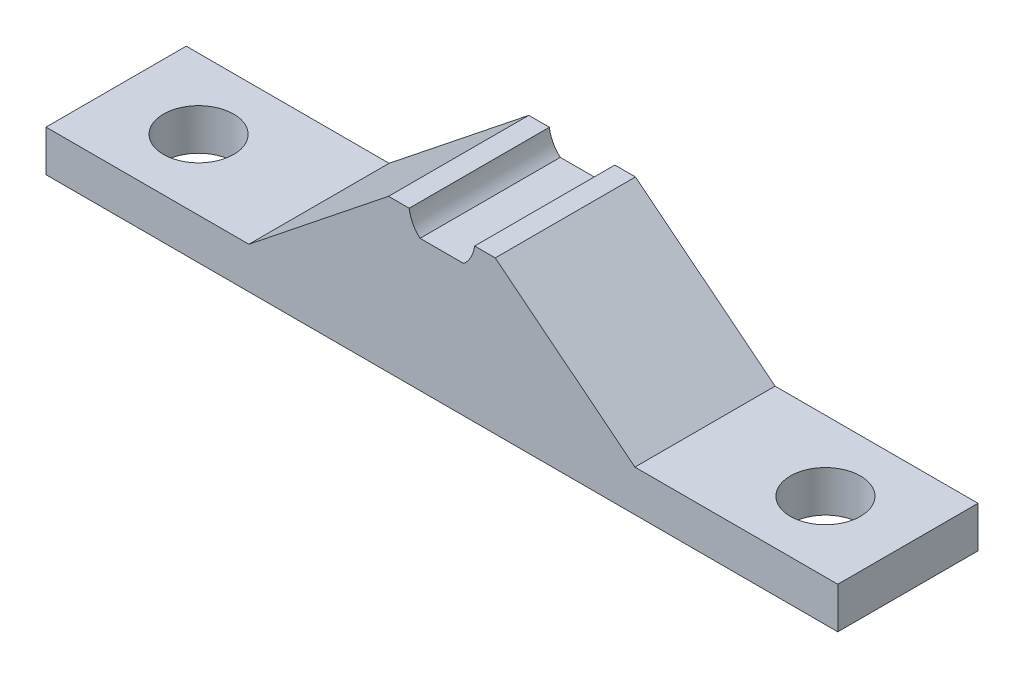
ISO-10303-21;
HEADER;
FILE_DESCRIPTION(('STEP AP214'),'2;1');
FILE_NAME('part.step','',(''),(''),'','','');
FILE_SCHEMA(('AUTOMOTIVE_DESIGN { 1 0 10303 214 1 1 1 1 }'));
ENDSEC;
DATA;
#1=APPLICATION_CONTEXT('core data for automotive mechanical design processes');
#2=APPLICATION_PROTOCOL_DEFINITION('international standard','automotive_design',2000,#1);
#3=PRODUCT_CONTEXT('',#1,'mechanical');
#4=PRODUCT('Part','Part','',(#3));
#5=PRODUCT_RELATED_PRODUCT_CATEGORY('part','',(#4));
#6=PRODUCT_DEFINITION_FORMATION('','',#4);
#7=PRODUCT_DEFINITION_CONTEXT('part definition',#1,'design');
#8=PRODUCT_DEFINITION('design','',#6,#7);
#9=PRODUCT_DEFINITION_SHAPE('','',#8);
#10=(LENGTH_UNIT() NAMED_UNIT(*) SI_UNIT(.MILLI.,.METRE.));
#11=(NAMED_UNIT(*) PLANE_ANGLE_UNIT() SI_UNIT($,.RADIAN.));
#12=(NAMED_UNIT(*) SI_UNIT($,.STERADIAN.) SOLID_ANGLE_UNIT());
#13=UNCERTAINTY_MEASURE_WITH_UNIT(LENGTH_MEASURE(1.E-05),#10,'distance_accuracy_value','');
#14=(GEOMETRIC_REPRESENTATION_CONTEXT(3) GLOBAL_UNCERTAINTY_ASSIGNED_CONTEXT((#13)) GLOBAL_UNIT_ASSIGNED_CONTEXT((#10,
#11,#12)) REPRESENTATION_CONTEXT('',''));
#15=CARTESIAN_POINT('',(0.,0.,0.));
#16=DIRECTION('',(0.,0.,1.));
#17=DIRECTION('',(1.,0.,0.));
#18=AXIS2_PLACEMENT_3D('',#15,#16,#17);
#19=CARTESIAN_POINT('',(0.,-37.9999999999996,-138.785495179433));
#20=DIRECTION('',(0.,-1.,0.));
#21=DIRECTION('',(1.,0.,0.));
#22=AXIS2_PLACEMENT_3D('',#19,#20,#21);
#23=PLANE('',#22);
#24=CARTESIAN_POINT('',(-75.9999999999999,-37.9999999999996,-16.9999999999999));
#25=DIRECTION('',(0.,-1.,0.));
#26=DIRECTION('',(1.,0.,0.));
#27=AXIS2_PLACEMENT_3D('',#24,#25,#26);
#28=CIRCLE('',#27,8.50000000000001);
#29=CARTESIAN_POINT('',(-67.4999999999999,-37.9999999999996,-16.9999999999999));
#30=VERTEX_POINT('',#29);
#31=EDGE_CURVE('E170',#30,#30,#28,.T.);
#32=ORIENTED_EDGE('',*,*,#31,.F.);
#33=EDGE_LOOP('',(#32));
#34=FACE_BOUND('',#33,.T.);
#35=DIRECTION('',(-1.,0.,0.));
#36=VECTOR('',#35,1.);
#37=CARTESIAN_POINT('',(0.,-37.9999999999996,-33.9999999999999));
#38=LINE('',#37,#36);
#39=CARTESIAN_POINT('',(95.9999999999999,-37.9999999999996,-33.9999999999999));
#40=VERTEX_POINT('',#39);
#41=CARTESIAN_POINT('',(-95.9999999999999,-37.9999999999996,-33.9999999999999));
#42=VERTEX_POINT('',#41);
#43=EDGE_CURVE('E56',#40,#42,#38,.T.);
#44=ORIENTED_EDGE('',*,*,#43,.F.);
#45=DIRECTION('',(0.,0.,1.));
#46=VECTOR('',#45,1.);
#47=CARTESIAN_POINT('',(95.9999999999999,-37.9999999999996,-138.785495179433));
#48=LINE('',#47,#46);
#49=CARTESIAN_POINT('',(95.9999999999999,-37.9999999999996,0.));
#50=VERTEX_POINT('',#49);
#51=EDGE_CURVE('E236',#40,#50,#48,.T.);
#52=ORIENTED_EDGE('',*,*,#51,.T.);
#53=DIRECTION('',(1.,0.,0.));
#54=VECTOR('',#53,1.);
#55=CARTESIAN_POINT('',(0.,-37.9999999999996,0.));
#56=LINE('',#55,#54);
#57=CARTESIAN_POINT('',(-95.9999999999999,-37.9999999999996,0.));
#58=VERTEX_POINT('',#57);
#59=EDGE_CURVE('E199',#58,#50,#56,.T.);
#60=ORIENTED_EDGE('',*,*,#59,.F.);
#61=DIRECTION('',(0.,0.,1.));
#62=VECTOR('',#61,1.);
#63=CARTESIAN_POINT('',(-95.9999999999999,-37.9999999999996,-138.785495179433));
#64=LINE('',#63,#62);
#65=EDGE_CURVE('E178',#42,#58,#64,.T.);
#66=ORIENTED_EDGE('',*,*,#65,.F.);
#67=EDGE_LOOP('',(#44,#52,#60,#66));
#68=FACE_BOUND('',#67,.T.);
#69=CARTESIAN_POINT('',(75.9999999999999,-37.9999999999996,-16.9999999999999));
#70=DIRECTION('',(0.,1.,0.));
#71=DIRECTION('',(-1.,0.,0.));
#72=AXIS2_PLACEMENT_3D('',#69,#70,#71);
#73=CIRCLE('',#72,8.50000000000001);
#74=CARTESIAN_POINT('',(67.4999999999999,-37.9999999999996,-16.9999999999999));
#75=VERTEX_POINT('',#74);
#76=EDGE_CURVE('E273',#75,#75,#73,.T.);
#77=ORIENTED_EDGE('',*,*,#76,.T.);
#78=EDGE_LOOP('',(#77));
#79=FACE_BOUND('',#78,.T.);
#80=ADVANCED_FACE('F48',(#34,#68,#79),#23,.T.);
#81=CARTESIAN_POINT('',(-95.9999999999999,-37.9999999999996,-138.785495179433));
#82=DIRECTION('',(-1.,0.,0.));
#83=DIRECTION('',(0.,0.,1.));
#84=AXIS2_PLACEMENT_3D('',#81,#82,#83);
#85=PLANE('',#84);
#86=DIRECTION('',(0.,1.,0.));
#87=VECTOR('',#86,1.);
#88=CARTESIAN_POINT('',(-95.9999999999999,-37.9999999999996,-33.9999999999999));
#89=LINE('',#88,#87);
#90=CARTESIAN_POINT('',(-95.9999999999999,-27.9999999999996,-33.9999999999999));
#91=VERTEX_POINT('',#90);
#92=EDGE_CURVE('E183',#42,#91,#89,.T.);
#93=ORIENTED_EDGE('',*,*,#92,.F.);
#94=ORIENTED_EDGE('',*,*,#65,.T.);
#95=DIRECTION('',(0.,-1.,0.));
#96=VECTOR('',#95,1.);
#97=CARTESIAN_POINT('',(-95.9999999999999,-37.9999999999996,0.));
#98=LINE('',#97,#96);
#99=CARTESIAN_POINT('',(-95.9999999999999,-27.9999999999996,0.));
#100=VERTEX_POINT('',#99);
#101=EDGE_CURVE('E196',#100,#58,#98,.T.);
#102=ORIENTED_EDGE('',*,*,#101,.F.);
#103=DIRECTION('',(0.,0.,1.));
#104=VECTOR('',#103,1.);
#105=CARTESIAN_POINT('',(-95.9999999999999,-27.9999999999996,-138.785495179433));
#106=LINE('',#105,#104);
#107=EDGE_CURVE('E202',#91,#100,#106,.T.);
#108=ORIENTED_EDGE('',*,*,#107,.F.);
#109=EDGE_LOOP('',(#93,#94,#102,#108));
#110=FACE_BOUND('',#109,.T.);
#111=ADVANCED_FACE('F228',(#110),#85,.T.);
#112=CARTESIAN_POINT('',(-95.9999999999999,-27.9999999999996,-138.785495179433));
#113=DIRECTION('',(0.,1.,0.));
#114=DIRECTION('',(-1.,0.,0.));
#115=AXIS2_PLACEMENT_3D('',#112,#113,#114);
#116=PLANE('',#115);
#117=CARTESIAN_POINT('',(-75.9999999999999,-27.9999999999996,-16.9999999999999));
#118=DIRECTION('',(0.,1.,0.));
#119=DIRECTION('',(-1.,0.,0.));
#120=AXIS2_PLACEMENT_3D('',#117,#118,#119);
#121=CIRCLE('',#120,8.50000000000001);
#122=CARTESIAN_POINT('',(-84.4999999999999,-27.9999999999996,-16.9999999999999));
#123=VERTEX_POINT('',#122);
#124=EDGE_CURVE('E146',#123,#123,#121,.F.);
#125=ORIENTED_EDGE('',*,*,#124,.T.);
#126=EDGE_LOOP('',(#125));
#127=FACE_BOUND('',#126,.T.);
#128=DIRECTION('',(1.,0.,0.));
#129=VECTOR('',#128,1.);
#130=CARTESIAN_POINT('',(-95.9999999999999,-27.9999999999996,-33.9999999999999));
#131=LINE('',#130,#129);
#132=CARTESIAN_POINT('',(-46.8017522130597,-27.9999999999996,-33.9999999999999));
#133=VERTEX_POINT('',#132);
#134=EDGE_CURVE('E181',#91,#133,#131,.T.);
#135=ORIENTED_EDGE('',*,*,#134,.F.);
#136=ORIENTED_EDGE('',*,*,#107,.T.);
#137=DIRECTION('',(-1.,0.,0.));
#138=VECTOR('',#137,1.);
#139=CARTESIAN_POINT('',(-95.9999999999999,-27.9999999999996,0.));
#140=LINE('',#139,#138);
#141=CARTESIAN_POINT('',(-46.8017522130597,-27.9999999999996,0.));
#142=VERTEX_POINT('',#141);
#143=EDGE_CURVE('E193',#142,#100,#140,.T.);
#144=ORIENTED_EDGE('',*,*,#143,.F.);
#145=DIRECTION('',(0.,0.,1.));
#146=VECTOR('',#145,1.);
#147=CARTESIAN_POINT('',(-46.8017522130597,-27.9999999999996,-138.785495179433));
#148=LINE('',#147,#146);
#149=EDGE_CURVE('E204',#133,#142,#148,.T.);
#150=ORIENTED_EDGE('',*,*,#149,.F.);
#151=EDGE_LOOP('',(#135,#136,#144,#150));
#152=FACE_BOUND('',#151,.T.);
#153=ADVANCED_FACE('F223',(#127,#152),#116,.T.);
#154=CARTESIAN_POINT('',(-46.8017522130597,-27.9999999999996,-138.785495179433));
#155=DIRECTION('',(-0.623404606589831,0.781899415834657,0.));
#156=DIRECTION('',(-0.781899415834657,-0.623404606589832,0.));
#157=AXIS2_PLACEMENT_3D('',#154,#155,#156);
#158=PLANE('',#157);
#159=DIRECTION('',(0.781899415834657,0.623404606589832,0.));
#160=VECTOR('',#159,1.);
#161=CARTESIAN_POINT('',(-46.8017522130597,-27.9999999999996,-33.9999999999999));
#162=LINE('',#161,#160);
#163=CARTESIAN_POINT('',(-12.937253933172,-1.,-33.9999999999999));
#164=VERTEX_POINT('',#163);
#165=EDGE_CURVE('E68',#133,#164,#162,.T.);
#166=ORIENTED_EDGE('',*,*,#165,.F.);
#167=ORIENTED_EDGE('',*,*,#149,.T.);
#168=DIRECTION('',(-0.781899415834657,-0.623404606589832,0.));
#169=VECTOR('',#168,1.);
#170=CARTESIAN_POINT('',(-46.8017522130597,-27.9999999999996,0.));
#171=LINE('',#170,#169);
#172=CARTESIAN_POINT('',(-12.937253933172,-1.,0.));
#173=VERTEX_POINT('',#172);
#174=EDGE_CURVE('E190',#173,#142,#171,.T.);
#175=ORIENTED_EDGE('',*,*,#174,.F.);
#176=DIRECTION('',(0.,0.,1.));
#177=VECTOR('',#176,1.);
#178=CARTESIAN_POINT('',(-12.937253933172,-1.,-138.785495179433));
#179=LINE('',#178,#177);
#180=EDGE_CURVE('E206',#164,#173,#179,.T.);
#181=ORIENTED_EDGE('',*,*,#180,.F.);
#182=EDGE_LOOP('',(#166,#167,#175,#181));
#183=FACE_BOUND('',#182,.T.);
#184=ADVANCED_FACE('F219',(#183),#158,.T.);
#185=CARTESIAN_POINT('',(-12.937253933172,-1.,-138.785495179433));
#186=DIRECTION('',(0.,1.,0.));
#187=DIRECTION('',(0.,0.,1.));
#188=AXIS2_PLACEMENT_3D('',#185,#186,#187);
#189=PLANE('',#188);
#190=DIRECTION('',(1.,0.,0.));
#191=VECTOR('',#190,1.);
#192=CARTESIAN_POINT('',(-12.937253933172,-1.,-33.9999999999999));
#193=LINE('',#192,#191);
#194=CARTESIAN_POINT('',(-7.93725393317202,-0.999999999999997,-33.9999999999999));
#195=VERTEX_POINT('',#194);
#196=EDGE_CURVE('E63',#164,#195,#193,.T.);
#197=ORIENTED_EDGE('',*,*,#196,.F.);
#198=ORIENTED_EDGE('',*,*,#180,.T.);
#199=DIRECTION('',(-1.,0.,0.));
#200=VECTOR('',#199,1.);
#201=CARTESIAN_POINT('',(-12.937253933172,-1.,0.));
#202=LINE('',#201,#200);
#203=CARTESIAN_POINT('',(-7.93725393317202,-0.999999999999997,0.));
#204=VERTEX_POINT('',#203);
#205=EDGE_CURVE('E187',#204,#173,#202,.T.);
#206=ORIENTED_EDGE('',*,*,#205,.F.);
#207=DIRECTION('',(0.,0.,1.));
#208=VECTOR('',#207,1.);
#209=CARTESIAN_POINT('',(-7.93725393317202,-0.999999999999997,-138.785495179433));
#210=LINE('',#209,#208);
#211=EDGE_CURVE('E208',#195,#204,#210,.T.);
#212=ORIENTED_EDGE('',*,*,#211,.F.);
#213=EDGE_LOOP('',(#197,#198,#206,#212));
#214=FACE_BOUND('',#213,.T.);
#215=ADVANCED_FACE('F214',(#214),#189,.T.);
#216=CARTESIAN_POINT('',(0.,0.,-138.785495179433));
#217=DIRECTION('',(0.,0.,1.));
#218=DIRECTION('',(1.,0.,0.));
#219=AXIS2_PLACEMENT_3D('',#216,#217,#218);
#220=CYLINDRICAL_SURFACE('',#219,7.99999999997842);
#221=CARTESIAN_POINT('',(0.,0.,-33.9999999999999));
#222=DIRECTION('',(0.,0.,1.));
#223=DIRECTION('',(1.,0.,0.));
#224=AXIS2_PLACEMENT_3D('',#221,#222,#223);
#225=CIRCLE('',#224,7.99999999997842);
#226=CARTESIAN_POINT('',(-5.29150262212852,-5.99999999997181,-33.9999999999999));
#227=VERTEX_POINT('',#226);
#228=EDGE_CURVE('E176',#195,#227,#225,.T.);
#229=ORIENTED_EDGE('',*,*,#228,.F.);
#230=ORIENTED_EDGE('',*,*,#211,.T.);
#231=CARTESIAN_POINT('',(0.,0.,0.));
#232=DIRECTION('',(0.,0.,-1.));
#233=DIRECTION('',(1.,0.,0.));
#234=AXIS2_PLACEMENT_3D('',#231,#232,#233);
#235=CIRCLE('',#234,7.99999999997842);
#236=CARTESIAN_POINT('',(-5.29150262212852,-5.99999999997181,0.));
#237=VERTEX_POINT('',#236);
#238=EDGE_CURVE('E145',#237,#204,#235,.T.);
#239=ORIENTED_EDGE('',*,*,#238,.F.);
#240=DIRECTION('',(0.,0.,1.));
#241=VECTOR('',#240,1.);
#242=CARTESIAN_POINT('',(-5.29150262212852,-5.99999999997181,-138.785495179433));
#243=LINE('',#242,#241);
#244=EDGE_CURVE('E141',#227,#237,#243,.T.);
#245=ORIENTED_EDGE('',*,*,#244,.F.);
#246=EDGE_LOOP('',(#229,#230,#239,#245));
#247=FACE_BOUND('',#246,.T.);
#248=ADVANCED_FACE('F212',(#247),#220,.F.);
#249=CARTESIAN_POINT('',(0.,-5.99999999997181,-138.785495179433));
#250=DIRECTION('',(0.,1.,0.));
#251=DIRECTION('',(-1.,0.,0.));
#252=AXIS2_PLACEMENT_3D('',#249,#250,#251);
#253=PLANE('',#252);
#254=DIRECTION('',(1.,0.,0.));
#255=VECTOR('',#254,1.);
#256=CARTESIAN_POINT('',(0.,-5.99999999997181,-33.9999999999999));
#257=LINE('',#256,#255);
#258=CARTESIAN_POINT('',(5.29150262212852,-5.99999999997181,-33.9999999999999));
#259=VERTEX_POINT('',#258);
#260=EDGE_CURVE('E14',#227,#259,#257,.T.);
#261=ORIENTED_EDGE('',*,*,#260,.F.);
#262=ORIENTED_EDGE('',*,*,#244,.T.);
#263=DIRECTION('',(-1.,0.,0.));
#264=VECTOR('',#263,1.);
#265=CARTESIAN_POINT('',(0.,-5.99999999997181,0.));
#266=LINE('',#265,#264);
#267=CARTESIAN_POINT('',(5.29150262212852,-5.99999999997181,0.));
#268=VERTEX_POINT('',#267);
#269=EDGE_CURVE('E134',#268,#237,#266,.T.);
#270=ORIENTED_EDGE('',*,*,#269,.F.);
#271=DIRECTION('',(0.,0.,1.));
#272=VECTOR('',#271,1.);
#273=CARTESIAN_POINT('',(5.29150262212852,-5.99999999997181,-138.785495179433));
#274=LINE('',#273,#272);
#275=EDGE_CURVE('E138',#259,#268,#274,.T.);
#276=ORIENTED_EDGE('',*,*,#275,.F.);
#277=EDGE_LOOP('',(#261,#262,#270,#276));
#278=FACE_BOUND('',#277,.T.);
#279=ADVANCED_FACE('F50',(#278),#253,.T.);
#280=CARTESIAN_POINT('',(0.,0.,0.));
#281=DIRECTION('',(0.,0.,1.));
#282=DIRECTION('',(1.,0.,0.));
#283=AXIS2_PLACEMENT_3D('',#280,#281,#282);
#284=PLANE('',#283);
#285=ORIENTED_EDGE('',*,*,#59,.T.);
#286=DIRECTION('',(0.,-1.,0.));
#287=VECTOR('',#286,1.);
#288=CARTESIAN_POINT('',(95.9999999999999,-37.9999999999996,0.));
#289=LINE('',#288,#287);
#290=CARTESIAN_POINT('',(95.9999999999999,-27.9999999999996,0.));
#291=VERTEX_POINT('',#290);
#292=EDGE_CURVE('E161',#291,#50,#289,.T.);
#293=ORIENTED_EDGE('',*,*,#292,.F.);
#294=DIRECTION('',(1.,0.,0.));
#295=VECTOR('',#294,1.);
#296=CARTESIAN_POINT('',(95.9999999999999,-27.9999999999996,0.));
#297=LINE('',#296,#295);
#298=CARTESIAN_POINT('',(46.8017522130597,-27.9999999999996,0.));
#299=VERTEX_POINT('',#298);
#300=EDGE_CURVE('E166',#299,#291,#297,.T.);
#301=ORIENTED_EDGE('',*,*,#300,.F.);
#302=DIRECTION('',(0.781899415834657,-0.623404606589831,0.));
#303=VECTOR('',#302,1.);
#304=CARTESIAN_POINT('',(46.8017522130597,-27.9999999999996,0.));
#305=LINE('',#304,#303);
#306=CARTESIAN_POINT('',(12.937253933172,-0.999999999999997,0.));
#307=VERTEX_POINT('',#306);
#308=EDGE_CURVE('E256',#307,#299,#305,.T.);
#309=ORIENTED_EDGE('',*,*,#308,.F.);
#310=DIRECTION('',(1.,0.,0.));
#311=VECTOR('',#310,1.);
#312=CARTESIAN_POINT('',(12.937253933172,-0.999999999999997,0.));
#313=LINE('',#312,#311);
#314=CARTESIAN_POINT('',(7.93725393317202,-0.999999999999997,0.));
#315=VERTEX_POINT('',#314);
#316=EDGE_CURVE('E152',#315,#307,#313,.T.);
#317=ORIENTED_EDGE('',*,*,#316,.F.);
#318=CARTESIAN_POINT('',(0.,0.,0.));
#319=DIRECTION('',(0.,0.,1.));
#320=DIRECTION('',(-1.,0.,0.));
#321=AXIS2_PLACEMENT_3D('',#318,#319,#320);
#322=CIRCLE('',#321,7.99999999997842);
#323=EDGE_CURVE('E149',#268,#315,#322,.T.);
#324=ORIENTED_EDGE('',*,*,#323,.F.);
#325=ORIENTED_EDGE('',*,*,#269,.T.);
#326=ORIENTED_EDGE('',*,*,#238,.T.);
#327=ORIENTED_EDGE('',*,*,#205,.T.);
#328=ORIENTED_EDGE('',*,*,#174,.T.);
#329=ORIENTED_EDGE('',*,*,#143,.T.);
#330=ORIENTED_EDGE('',*,*,#101,.T.);
#331=EDGE_LOOP('',(#285,#293,#301,#309,#317,#324,#325,#326,#327,#328,#329,#330));
#332=FACE_BOUND('',#331,.T.);
#333=ADVANCED_FACE('F150',(#332),#284,.T.);
#334=CARTESIAN_POINT('',(7.99999999999956,0.,-33.9999999999999));
#335=DIRECTION('',(0.,0.,1.));
#336=DIRECTION('',(0.,-1.,0.));
#337=AXIS2_PLACEMENT_3D('',#334,#335,#336);
#338=PLANE('',#337);
#339=ORIENTED_EDGE('',*,*,#260,.T.);
#340=CARTESIAN_POINT('',(0.,0.,-33.9999999999999));
#341=DIRECTION('',(0.,0.,-1.));
#342=DIRECTION('',(-1.,0.,0.));
#343=AXIS2_PLACEMENT_3D('',#340,#341,#342);
#344=CIRCLE('',#343,7.99999999997842);
#345=CARTESIAN_POINT('',(7.93725393317202,-0.999999999999997,-33.9999999999999));
#346=VERTEX_POINT('',#345);
#347=EDGE_CURVE('E159',#346,#259,#344,.T.);
#348=ORIENTED_EDGE('',*,*,#347,.F.);
#349=DIRECTION('',(-1.,0.,0.));
#350=VECTOR('',#349,1.);
#351=CARTESIAN_POINT('',(12.937253933172,-0.999999999999997,-33.9999999999999));
#352=LINE('',#351,#350);
#353=CARTESIAN_POINT('',(12.937253933172,-0.999999999999997,-33.9999999999999));
#354=VERTEX_POINT('',#353);
#355=EDGE_CURVE('E242',#354,#346,#352,.T.);
#356=ORIENTED_EDGE('',*,*,#355,.F.);
#357=DIRECTION('',(-0.781899415834657,0.623404606589831,0.));
#358=VECTOR('',#357,1.);
#359=CARTESIAN_POINT('',(46.8017522130597,-27.9999999999996,-33.9999999999999));
#360=LINE('',#359,#358);
#361=CARTESIAN_POINT('',(46.8017522130597,-27.9999999999996,-33.9999999999999));
#362=VERTEX_POINT('',#361);
#363=EDGE_CURVE('E258',#362,#354,#360,.T.);
#364=ORIENTED_EDGE('',*,*,#363,.F.);
#365=DIRECTION('',(-1.,0.,0.));
#366=VECTOR('',#365,1.);
#367=CARTESIAN_POINT('',(95.9999999999999,-27.9999999999996,-33.9999999999999));
#368=LINE('',#367,#366);
#369=CARTESIAN_POINT('',(95.9999999999999,-27.9999999999996,-33.9999999999999));
#370=VERTEX_POINT('',#369);
#371=EDGE_CURVE('E266',#370,#362,#368,.T.);
#372=ORIENTED_EDGE('',*,*,#371,.F.);
#373=DIRECTION('',(0.,1.,0.));
#374=VECTOR('',#373,1.);
#375=CARTESIAN_POINT('',(95.9999999999999,-37.9999999999996,-33.9999999999999));
#376=LINE('',#375,#374);
#377=EDGE_CURVE('E173',#40,#370,#376,.T.);
#378=ORIENTED_EDGE('',*,*,#377,.F.);
#379=ORIENTED_EDGE('',*,*,#43,.T.);
#380=ORIENTED_EDGE('',*,*,#92,.T.);
#381=ORIENTED_EDGE('',*,*,#134,.T.);
#382=ORIENTED_EDGE('',*,*,#165,.T.);
#383=ORIENTED_EDGE('',*,*,#196,.T.);
#384=ORIENTED_EDGE('',*,*,#228,.T.);
#385=EDGE_LOOP('',(#339,#348,#356,#364,#372,#378,#379,#380,#381,#382,#383,#384));
#386=FACE_BOUND('',#385,.T.);
#387=ADVANCED_FACE('F289',(#386),#338,.F.);
#388=CARTESIAN_POINT('',(-75.9999999999999,-3.95836943965692,-16.9999999999999));
#389=DIRECTION('',(0.,-1.,0.));
#390=DIRECTION('',(1.,0.,0.));
#391=AXIS2_PLACEMENT_3D('',#388,#389,#390);
#392=CYLINDRICAL_SURFACE('',#391,8.50000000000001);
#393=ORIENTED_EDGE('',*,*,#31,.T.);
#394=EDGE_LOOP('',(#393));
#395=FACE_BOUND('',#394,.T.);
#396=ORIENTED_EDGE('',*,*,#124,.F.);
#397=EDGE_LOOP('',(#396));
#398=FACE_BOUND('',#397,.T.);
#399=ADVANCED_FACE('F291',(#395,#398),#392,.F.);
#400=CARTESIAN_POINT('',(95.9999999999999,-37.9999999999996,-138.785495179433));
#401=DIRECTION('',(1.,0.,0.));
#402=DIRECTION('',(0.,0.,1.));
#403=AXIS2_PLACEMENT_3D('',#400,#401,#402);
#404=PLANE('',#403);
#405=ORIENTED_EDGE('',*,*,#377,.T.);
#406=DIRECTION('',(0.,0.,1.));
#407=VECTOR('',#406,1.);
#408=CARTESIAN_POINT('',(95.9999999999999,-27.9999999999996,-138.785495179433));
#409=LINE('',#408,#407);
#410=EDGE_CURVE('E240',#370,#291,#409,.T.);
#411=ORIENTED_EDGE('',*,*,#410,.T.);
#412=ORIENTED_EDGE('',*,*,#292,.T.);
#413=ORIENTED_EDGE('',*,*,#51,.F.);
#414=EDGE_LOOP('',(#405,#411,#412,#413));
#415=FACE_BOUND('',#414,.T.);
#416=ADVANCED_FACE('F286',(#415),#404,.T.);
#417=CARTESIAN_POINT('',(95.9999999999999,-27.9999999999996,-138.785495179433));
#418=DIRECTION('',(0.,1.,0.));
#419=DIRECTION('',(1.,0.,0.));
#420=AXIS2_PLACEMENT_3D('',#417,#418,#419);
#421=PLANE('',#420);
#422=CARTESIAN_POINT('',(75.9999999999999,-27.9999999999996,-16.9999999999999));
#423=DIRECTION('',(0.,-1.,0.));
#424=DIRECTION('',(1.,0.,0.));
#425=AXIS2_PLACEMENT_3D('',#422,#423,#424);
#426=CIRCLE('',#425,8.50000000000001);
#427=CARTESIAN_POINT('',(84.4999999999999,-27.9999999999996,-16.9999999999999));
#428=VERTEX_POINT('',#427);
#429=EDGE_CURVE('E156',#428,#428,#426,.F.);
#430=ORIENTED_EDGE('',*,*,#429,.F.);
#431=EDGE_LOOP('',(#430));
#432=FACE_BOUND('',#431,.T.);
#433=ORIENTED_EDGE('',*,*,#371,.T.);
#434=DIRECTION('',(0.,0.,1.));
#435=VECTOR('',#434,1.);
#436=CARTESIAN_POINT('',(46.8017522130597,-27.9999999999996,-138.785495179433));
#437=LINE('',#436,#435);
#438=EDGE_CURVE('E245',#362,#299,#437,.T.);
#439=ORIENTED_EDGE('',*,*,#438,.T.);
#440=ORIENTED_EDGE('',*,*,#300,.T.);
#441=ORIENTED_EDGE('',*,*,#410,.F.);
#442=EDGE_LOOP('',(#433,#439,#440,#441));
#443=FACE_BOUND('',#442,.T.);
#444=ADVANCED_FACE('F283',(#432,#443),#421,.T.);
#445=CARTESIAN_POINT('',(46.8017522130597,-27.9999999999996,-138.785495179433));
#446=DIRECTION('',(0.623404606589831,0.781899415834657,0.));
#447=DIRECTION('',(0.781899415834657,-0.623404606589831,0.));
#448=AXIS2_PLACEMENT_3D('',#445,#446,#447);
#449=PLANE('',#448);
#450=ORIENTED_EDGE('',*,*,#363,.T.);
#451=DIRECTION('',(0.,0.,1.));
#452=VECTOR('',#451,1.);
#453=CARTESIAN_POINT('',(12.937253933172,-0.999999999999997,-138.785495179433));
#454=LINE('',#453,#452);
#455=EDGE_CURVE('E163',#354,#307,#454,.T.);
#456=ORIENTED_EDGE('',*,*,#455,.T.);
#457=ORIENTED_EDGE('',*,*,#308,.T.);
#458=ORIENTED_EDGE('',*,*,#438,.F.);
#459=EDGE_LOOP('',(#450,#456,#457,#458));
#460=FACE_BOUND('',#459,.T.);
#461=ADVANCED_FACE('F254',(#460),#449,.T.);
#462=CARTESIAN_POINT('',(12.937253933172,-0.999999999999997,-138.785495179433));
#463=DIRECTION('',(0.,1.,0.));
#464=DIRECTION('',(0.,0.,1.));
#465=AXIS2_PLACEMENT_3D('',#462,#463,#464);
#466=PLANE('',#465);
#467=ORIENTED_EDGE('',*,*,#355,.T.);
#468=DIRECTION('',(0.,0.,1.));
#469=VECTOR('',#468,1.);
#470=CARTESIAN_POINT('',(7.93725393317202,-0.999999999999997,-138.785495179433));
#471=LINE('',#470,#469);
#472=EDGE_CURVE('E160',#346,#315,#471,.T.);
#473=ORIENTED_EDGE('',*,*,#472,.T.);
#474=ORIENTED_EDGE('',*,*,#316,.T.);
#475=ORIENTED_EDGE('',*,*,#455,.F.);
#476=EDGE_LOOP('',(#467,#473,#474,#475));
#477=FACE_BOUND('',#476,.T.);
#478=ADVANCED_FACE('F261',(#477),#466,.T.);
#479=CARTESIAN_POINT('',(0.,0.,-138.785495179433));
#480=DIRECTION('',(0.,0.,1.));
#481=DIRECTION('',(-1.,0.,0.));
#482=AXIS2_PLACEMENT_3D('',#479,#480,#481);
#483=CYLINDRICAL_SURFACE('',#482,7.99999999997842);
#484=ORIENTED_EDGE('',*,*,#347,.T.);
#485=ORIENTED_EDGE('',*,*,#275,.T.);
#486=ORIENTED_EDGE('',*,*,#323,.T.);
#487=ORIENTED_EDGE('',*,*,#472,.F.);
#488=EDGE_LOOP('',(#484,#485,#486,#487));
#489=FACE_BOUND('',#488,.T.);
#490=ADVANCED_FACE('F158',(#489),#483,.F.);
#491=CARTESIAN_POINT('',(75.9999999999999,-3.95836943965691,-16.9999999999999));
#492=DIRECTION('',(0.,-1.,0.));
#493=DIRECTION('',(-1.,0.,0.));
#494=AXIS2_PLACEMENT_3D('',#491,#492,#493);
#495=CYLINDRICAL_SURFACE('',#494,8.50000000000001);
#496=ORIENTED_EDGE('',*,*,#76,.F.);
#497=EDGE_LOOP('',(#496));
#498=FACE_BOUND('',#497,.T.);
#499=ORIENTED_EDGE('',*,*,#429,.T.);
#500=EDGE_LOOP('',(#499));
#501=FACE_BOUND('',#500,.T.);
#502=ADVANCED_FACE('F277',(#498,#501),#495,.F.);
#503=CLOSED_SHELL('',(#80,#111,#153,#184,#215,#248,#279,#333,#387,#399,#416,#444,#461,#478,#490,#502));
#504=MANIFOLD_SOLID_BREP('B2',#503);
#505=ADVANCED_BREP_SHAPE_REPRESENTATION('',(#18,#504),#14);
#506=SHAPE_DEFINITION_REPRESENTATION(#9,#505);
ENDSEC;
END-ISO-10303-21;
